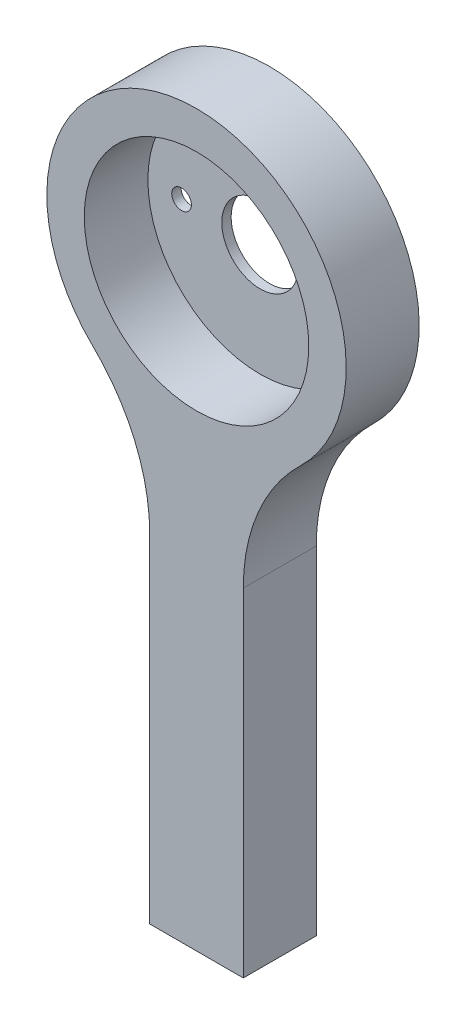
ISO-10303-21;
HEADER;
FILE_DESCRIPTION(('STEP AP214'),'2;1');
FILE_NAME('part.step','',(''),(''),'','','');
FILE_SCHEMA(('AUTOMOTIVE_DESIGN { 1 0 10303 214 1 1 1 1 }'));
ENDSEC;
DATA;
#1=APPLICATION_CONTEXT('core data for automotive mechanical design processes');
#2=APPLICATION_PROTOCOL_DEFINITION('international standard','automotive_design',2000,#1);
#3=PRODUCT_CONTEXT('',#1,'mechanical');
#4=PRODUCT('Part','Part','',(#3));
#5=PRODUCT_RELATED_PRODUCT_CATEGORY('part','',(#4));
#6=PRODUCT_DEFINITION_FORMATION('','',#4);
#7=PRODUCT_DEFINITION_CONTEXT('part definition',#1,'design');
#8=PRODUCT_DEFINITION('design','',#6,#7);
#9=PRODUCT_DEFINITION_SHAPE('','',#8);
#10=(LENGTH_UNIT() NAMED_UNIT(*) SI_UNIT(.MILLI.,.METRE.));
#11=(NAMED_UNIT(*) PLANE_ANGLE_UNIT() SI_UNIT($,.RADIAN.));
#12=(NAMED_UNIT(*) SI_UNIT($,.STERADIAN.) SOLID_ANGLE_UNIT());
#13=UNCERTAINTY_MEASURE_WITH_UNIT(LENGTH_MEASURE(1.E-05),#10,'distance_accuracy_value','');
#14=(GEOMETRIC_REPRESENTATION_CONTEXT(3) GLOBAL_UNCERTAINTY_ASSIGNED_CONTEXT((#13)) GLOBAL_UNIT_ASSIGNED_CONTEXT((#10,
#11,#12)) REPRESENTATION_CONTEXT('',''));
#15=CARTESIAN_POINT('',(0.,0.,0.));
#16=DIRECTION('',(0.,0.,1.));
#17=DIRECTION('',(1.,0.,0.));
#18=AXIS2_PLACEMENT_3D('',#15,#16,#17);
#19=CARTESIAN_POINT('',(0.,0.,3.9));
#20=DIRECTION('',(0.,0.,-1.));
#21=DIRECTION('',(-1.,0.,0.));
#22=AXIS2_PLACEMENT_3D('',#19,#20,#21);
#23=CYLINDRICAL_SURFACE('',#22,6.);
#24=CARTESIAN_POINT('',(0.,0.,3.9));
#25=DIRECTION('',(0.,0.,1.));
#26=DIRECTION('',(1.,0.,0.));
#27=AXIS2_PLACEMENT_3D('',#24,#25,#26);
#28=CIRCLE('',#27,6.);
#29=CARTESIAN_POINT('',(6.,0.,3.9));
#30=VERTEX_POINT('',#29);
#31=EDGE_CURVE('E126',#30,#30,#28,.T.);
#32=ORIENTED_EDGE('',*,*,#31,.T.);
#33=EDGE_LOOP('',(#32));
#34=FACE_BOUND('',#33,.T.);
#35=CARTESIAN_POINT('',(0.,0.,0.5));
#36=DIRECTION('',(0.,0.,-1.));
#37=DIRECTION('',(-1.,0.,0.));
#38=AXIS2_PLACEMENT_3D('',#35,#36,#37);
#39=CIRCLE('',#38,6.);
#40=CARTESIAN_POINT('',(-6.,0.,0.5));
#41=VERTEX_POINT('',#40);
#42=EDGE_CURVE('E40',#41,#41,#39,.T.);
#43=ORIENTED_EDGE('',*,*,#42,.T.);
#44=EDGE_LOOP('',(#43));
#45=FACE_BOUND('',#44,.T.);
#46=ADVANCED_FACE('F36',(#34,#45),#23,.F.);
#47=CARTESIAN_POINT('',(12.5,-12.9518338469886,3.9));
#48=DIRECTION('',(0.,0.,1.));
#49=DIRECTION('',(1.,0.,0.));
#50=AXIS2_PLACEMENT_3D('',#47,#48,#49);
#51=PLANE('',#50);
#52=CARTESIAN_POINT('',(12.5,-12.9518338469886,3.9));
#53=DIRECTION('',(0.,0.,-1.));
#54=DIRECTION('',(1.,0.,0.));
#55=AXIS2_PLACEMENT_3D('',#52,#53,#54);
#56=CIRCLE('',#55,10.);
#57=CARTESIAN_POINT('',(2.5,-12.9518338469886,3.9));
#58=VERTEX_POINT('',#57);
#59=CARTESIAN_POINT('',(5.55555555555555,-5.75637059866161,3.9));
#60=VERTEX_POINT('',#59);
#61=EDGE_CURVE('E134',#58,#60,#56,.T.);
#62=ORIENTED_EDGE('',*,*,#61,.T.);
#63=CARTESIAN_POINT('',(0.,0.,3.9));
#64=DIRECTION('',(0.,0.,1.));
#65=DIRECTION('',(1.,0.,0.));
#66=AXIS2_PLACEMENT_3D('',#63,#64,#65);
#67=CIRCLE('',#66,8.);
#68=CARTESIAN_POINT('',(-5.55555555555556,-5.7563705986616,3.9));
#69=VERTEX_POINT('',#68);
#70=EDGE_CURVE('E90',#60,#69,#67,.T.);
#71=ORIENTED_EDGE('',*,*,#70,.T.);
#72=CARTESIAN_POINT('',(-12.5,-12.9518338469886,3.9));
#73=DIRECTION('',(0.,0.,-1.));
#74=DIRECTION('',(-1.,0.,0.));
#75=AXIS2_PLACEMENT_3D('',#72,#73,#74);
#76=CIRCLE('',#75,10.);
#77=CARTESIAN_POINT('',(-2.5,-12.9518338469886,3.9));
#78=VERTEX_POINT('',#77);
#79=EDGE_CURVE('E104',#69,#78,#76,.T.);
#80=ORIENTED_EDGE('',*,*,#79,.T.);
#81=DIRECTION('',(0.,-1.,0.));
#82=VECTOR('',#81,1.);
#83=CARTESIAN_POINT('',(-2.5,-12.9518338469886,3.9));
#84=LINE('',#83,#82);
#85=CARTESIAN_POINT('',(-2.5,-31.,3.9));
#86=VERTEX_POINT('',#85);
#87=EDGE_CURVE('E97',#78,#86,#84,.T.);
#88=ORIENTED_EDGE('',*,*,#87,.T.);
#89=DIRECTION('',(1.,0.,0.));
#90=VECTOR('',#89,1.);
#91=CARTESIAN_POINT('',(-2.5,-31.,3.9));
#92=LINE('',#91,#90);
#93=CARTESIAN_POINT('',(2.5,-31.,3.9));
#94=VERTEX_POINT('',#93);
#95=EDGE_CURVE('E102',#86,#94,#92,.T.);
#96=ORIENTED_EDGE('',*,*,#95,.T.);
#97=DIRECTION('',(0.,1.,0.));
#98=VECTOR('',#97,1.);
#99=CARTESIAN_POINT('',(2.5,-12.9518338469886,3.9));
#100=LINE('',#99,#98);
#101=EDGE_CURVE('E54',#94,#58,#100,.T.);
#102=ORIENTED_EDGE('',*,*,#101,.T.);
#103=EDGE_LOOP('',(#62,#71,#80,#88,#96,#102));
#104=FACE_BOUND('',#103,.T.);
#105=ORIENTED_EDGE('',*,*,#31,.F.);
#106=EDGE_LOOP('',(#105));
#107=FACE_BOUND('',#106,.T.);
#108=ADVANCED_FACE('F99',(#104,#107),#51,.T.);
#109=CARTESIAN_POINT('',(12.5,-12.9518338469886,0.));
#110=DIRECTION('',(0.,0.,1.));
#111=DIRECTION('',(1.,0.,0.));
#112=AXIS2_PLACEMENT_3D('',#109,#110,#111);
#113=PLANE('',#112);
#114=CARTESIAN_POINT('',(-12.5,-12.9518338469886,0.));
#115=DIRECTION('',(0.,0.,-1.));
#116=DIRECTION('',(-1.,0.,0.));
#117=AXIS2_PLACEMENT_3D('',#114,#115,#116);
#118=CIRCLE('',#117,10.);
#119=CARTESIAN_POINT('',(-5.55555555555556,-5.7563705986616,0.));
#120=VERTEX_POINT('',#119);
#121=CARTESIAN_POINT('',(-2.5,-12.9518338469886,0.));
#122=VERTEX_POINT('',#121);
#123=EDGE_CURVE('E129',#120,#122,#118,.T.);
#124=ORIENTED_EDGE('',*,*,#123,.F.);
#125=CARTESIAN_POINT('',(0.,0.,0.));
#126=DIRECTION('',(0.,0.,1.));
#127=DIRECTION('',(1.,0.,0.));
#128=AXIS2_PLACEMENT_3D('',#125,#126,#127);
#129=CIRCLE('',#128,8.);
#130=CARTESIAN_POINT('',(5.55555555555555,-5.75637059866161,0.));
#131=VERTEX_POINT('',#130);
#132=EDGE_CURVE('E125',#131,#120,#129,.T.);
#133=ORIENTED_EDGE('',*,*,#132,.F.);
#134=CARTESIAN_POINT('',(12.5,-12.9518338469886,0.));
#135=DIRECTION('',(0.,0.,-1.));
#136=DIRECTION('',(1.,0.,0.));
#137=AXIS2_PLACEMENT_3D('',#134,#135,#136);
#138=CIRCLE('',#137,10.);
#139=CARTESIAN_POINT('',(2.5,-12.9518338469886,0.));
#140=VERTEX_POINT('',#139);
#141=EDGE_CURVE('E122',#140,#131,#138,.T.);
#142=ORIENTED_EDGE('',*,*,#141,.F.);
#143=DIRECTION('',(0.,1.,0.));
#144=VECTOR('',#143,1.);
#145=CARTESIAN_POINT('',(2.5,-12.9518338469886,0.));
#146=LINE('',#145,#144);
#147=CARTESIAN_POINT('',(2.5,-31.,0.));
#148=VERTEX_POINT('',#147);
#149=EDGE_CURVE('E82',#148,#140,#146,.T.);
#150=ORIENTED_EDGE('',*,*,#149,.F.);
#151=DIRECTION('',(1.,0.,0.));
#152=VECTOR('',#151,1.);
#153=CARTESIAN_POINT('',(-2.5,-31.,0.));
#154=LINE('',#153,#152);
#155=CARTESIAN_POINT('',(-2.5,-31.,0.));
#156=VERTEX_POINT('',#155);
#157=EDGE_CURVE('E76',#156,#148,#154,.T.);
#158=ORIENTED_EDGE('',*,*,#157,.F.);
#159=DIRECTION('',(0.,-1.,0.));
#160=VECTOR('',#159,1.);
#161=CARTESIAN_POINT('',(-2.5,-12.9518338469886,0.));
#162=LINE('',#161,#160);
#163=EDGE_CURVE('E112',#122,#156,#162,.T.);
#164=ORIENTED_EDGE('',*,*,#163,.F.);
#165=EDGE_LOOP('',(#124,#133,#142,#150,#158,#164));
#166=FACE_BOUND('',#165,.T.);
#167=CARTESIAN_POINT('',(0.,0.,0.));
#168=DIRECTION('',(0.,0.,-1.));
#169=DIRECTION('',(-1.,0.,0.));
#170=AXIS2_PLACEMENT_3D('',#167,#168,#169);
#171=CIRCLE('',#170,2.05);
#172=CARTESIAN_POINT('',(-2.05,0.,0.));
#173=VERTEX_POINT('',#172);
#174=EDGE_CURVE('E273',#173,#173,#171,.T.);
#175=ORIENTED_EDGE('',*,*,#174,.F.);
#176=EDGE_LOOP('',(#175));
#177=FACE_BOUND('',#176,.T.);
#178=CARTESIAN_POINT('',(-4.2,0.,0.));
#179=DIRECTION('',(0.,0.,-1.));
#180=DIRECTION('',(-1.,0.,0.));
#181=AXIS2_PLACEMENT_3D('',#178,#179,#180);
#182=CIRCLE('',#181,0.525);
#183=CARTESIAN_POINT('',(-4.725,0.,0.));
#184=VERTEX_POINT('',#183);
#185=EDGE_CURVE('E267',#184,#184,#182,.T.);
#186=ORIENTED_EDGE('',*,*,#185,.F.);
#187=EDGE_LOOP('',(#186));
#188=FACE_BOUND('',#187,.T.);
#189=CARTESIAN_POINT('',(4.2,0.,0.));
#190=DIRECTION('',(0.,0.,-1.));
#191=DIRECTION('',(-1.,0.,0.));
#192=AXIS2_PLACEMENT_3D('',#189,#190,#191);
#193=CIRCLE('',#192,0.525);
#194=CARTESIAN_POINT('',(3.675,0.,0.));
#195=VERTEX_POINT('',#194);
#196=EDGE_CURVE('E264',#195,#195,#193,.T.);
#197=ORIENTED_EDGE('',*,*,#196,.F.);
#198=EDGE_LOOP('',(#197));
#199=FACE_BOUND('',#198,.T.);
#200=ADVANCED_FACE('F146',(#166,#177,#188,#199),#113,.F.);
#201=CARTESIAN_POINT('',(12.5,-12.9518338469886,3.9));
#202=DIRECTION('',(0.,0.,-1.));
#203=DIRECTION('',(-1.,0.,0.));
#204=AXIS2_PLACEMENT_3D('',#201,#202,#203);
#205=CYLINDRICAL_SURFACE('',#204,10.);
#206=ORIENTED_EDGE('',*,*,#141,.T.);
#207=DIRECTION('',(0.,0.,-1.));
#208=VECTOR('',#207,1.);
#209=CARTESIAN_POINT('',(5.55555555555555,-5.75637059866161,3.9));
#210=LINE('',#209,#208);
#211=EDGE_CURVE('E11',#60,#131,#210,.T.);
#212=ORIENTED_EDGE('',*,*,#211,.F.);
#213=ORIENTED_EDGE('',*,*,#61,.F.);
#214=DIRECTION('',(0.,0.,-1.));
#215=VECTOR('',#214,1.);
#216=CARTESIAN_POINT('',(2.5,-12.9518338469886,3.9));
#217=LINE('',#216,#215);
#218=EDGE_CURVE('E118',#58,#140,#217,.T.);
#219=ORIENTED_EDGE('',*,*,#218,.T.);
#220=EDGE_LOOP('',(#206,#212,#213,#219));
#221=FACE_BOUND('',#220,.T.);
#222=ADVANCED_FACE('F38',(#221),#205,.F.);
#223=CARTESIAN_POINT('',(0.,0.,3.9));
#224=DIRECTION('',(0.,0.,-1.));
#225=DIRECTION('',(-1.,0.,0.));
#226=AXIS2_PLACEMENT_3D('',#223,#224,#225);
#227=CYLINDRICAL_SURFACE('',#226,8.);
#228=ORIENTED_EDGE('',*,*,#132,.T.);
#229=DIRECTION('',(0.,0.,-1.));
#230=VECTOR('',#229,1.);
#231=CARTESIAN_POINT('',(-5.55555555555556,-5.7563705986616,3.9));
#232=LINE('',#231,#230);
#233=EDGE_CURVE('E46',#69,#120,#232,.T.);
#234=ORIENTED_EDGE('',*,*,#233,.F.);
#235=ORIENTED_EDGE('',*,*,#70,.F.);
#236=ORIENTED_EDGE('',*,*,#211,.T.);
#237=EDGE_LOOP('',(#228,#234,#235,#236));
#238=FACE_BOUND('',#237,.T.);
#239=ADVANCED_FACE('F142',(#238),#227,.T.);
#240=CARTESIAN_POINT('',(-12.5,-12.9518338469886,3.9));
#241=DIRECTION('',(0.,0.,-1.));
#242=DIRECTION('',(-1.,0.,0.));
#243=AXIS2_PLACEMENT_3D('',#240,#241,#242);
#244=CYLINDRICAL_SURFACE('',#243,10.);
#245=ORIENTED_EDGE('',*,*,#123,.T.);
#246=DIRECTION('',(0.,0.,-1.));
#247=VECTOR('',#246,1.);
#248=CARTESIAN_POINT('',(-2.5,-12.9518338469886,3.9));
#249=LINE('',#248,#247);
#250=EDGE_CURVE('E113',#78,#122,#249,.T.);
#251=ORIENTED_EDGE('',*,*,#250,.F.);
#252=ORIENTED_EDGE('',*,*,#79,.F.);
#253=ORIENTED_EDGE('',*,*,#233,.T.);
#254=EDGE_LOOP('',(#245,#251,#252,#253));
#255=FACE_BOUND('',#254,.T.);
#256=ADVANCED_FACE('F139',(#255),#244,.F.);
#257=CARTESIAN_POINT('',(-2.5,-12.9518338469886,3.9));
#258=DIRECTION('',(1.,0.,0.));
#259=DIRECTION('',(0.,1.,0.));
#260=AXIS2_PLACEMENT_3D('',#257,#258,#259);
#261=PLANE('',#260);
#262=ORIENTED_EDGE('',*,*,#163,.T.);
#263=DIRECTION('',(0.,0.,-1.));
#264=VECTOR('',#263,1.);
#265=CARTESIAN_POINT('',(-2.5,-31.,3.9));
#266=LINE('',#265,#264);
#267=EDGE_CURVE('E109',#86,#156,#266,.T.);
#268=ORIENTED_EDGE('',*,*,#267,.F.);
#269=ORIENTED_EDGE('',*,*,#87,.F.);
#270=ORIENTED_EDGE('',*,*,#250,.T.);
#271=EDGE_LOOP('',(#262,#268,#269,#270));
#272=FACE_BOUND('',#271,.T.);
#273=ADVANCED_FACE('F110',(#272),#261,.F.);
#274=CARTESIAN_POINT('',(-2.5,-31.,3.9));
#275=DIRECTION('',(0.,1.,0.));
#276=DIRECTION('',(0.,0.,1.));
#277=AXIS2_PLACEMENT_3D('',#274,#275,#276);
#278=PLANE('',#277);
#279=ORIENTED_EDGE('',*,*,#157,.T.);
#280=DIRECTION('',(0.,0.,-1.));
#281=VECTOR('',#280,1.);
#282=CARTESIAN_POINT('',(2.5,-31.,3.9));
#283=LINE('',#282,#281);
#284=EDGE_CURVE('E114',#94,#148,#283,.T.);
#285=ORIENTED_EDGE('',*,*,#284,.F.);
#286=ORIENTED_EDGE('',*,*,#95,.F.);
#287=ORIENTED_EDGE('',*,*,#267,.T.);
#288=EDGE_LOOP('',(#279,#285,#286,#287));
#289=FACE_BOUND('',#288,.T.);
#290=ADVANCED_FACE('F116',(#289),#278,.F.);
#291=CARTESIAN_POINT('',(2.5,-12.9518338469886,3.9));
#292=DIRECTION('',(-1.,0.,0.));
#293=DIRECTION('',(0.,-1.,0.));
#294=AXIS2_PLACEMENT_3D('',#291,#292,#293);
#295=PLANE('',#294);
#296=ORIENTED_EDGE('',*,*,#149,.T.);
#297=ORIENTED_EDGE('',*,*,#218,.F.);
#298=ORIENTED_EDGE('',*,*,#101,.F.);
#299=ORIENTED_EDGE('',*,*,#284,.T.);
#300=EDGE_LOOP('',(#296,#297,#298,#299));
#301=FACE_BOUND('',#300,.T.);
#302=ADVANCED_FACE('F150',(#301),#295,.F.);
#303=CARTESIAN_POINT('',(0.,0.,0.5));
#304=DIRECTION('',(0.,0.,-1.));
#305=DIRECTION('',(-1.,0.,0.));
#306=AXIS2_PLACEMENT_3D('',#303,#304,#305);
#307=PLANE('',#306);
#308=CARTESIAN_POINT('',(0.,0.,0.5));
#309=DIRECTION('',(0.,0.,-1.));
#310=DIRECTION('',(-1.,0.,0.));
#311=AXIS2_PLACEMENT_3D('',#308,#309,#310);
#312=CIRCLE('',#311,2.05);
#313=CARTESIAN_POINT('',(-2.05,0.,0.5));
#314=VERTEX_POINT('',#313);
#315=EDGE_CURVE('E276',#314,#314,#312,.T.);
#316=ORIENTED_EDGE('',*,*,#315,.T.);
#317=EDGE_LOOP('',(#316));
#318=FACE_BOUND('',#317,.T.);
#319=CARTESIAN_POINT('',(-4.2,0.,0.5));
#320=DIRECTION('',(0.,0.,-1.));
#321=DIRECTION('',(-1.,0.,0.));
#322=AXIS2_PLACEMENT_3D('',#319,#320,#321);
#323=CIRCLE('',#322,0.525);
#324=CARTESIAN_POINT('',(-4.725,0.,0.5));
#325=VERTEX_POINT('',#324);
#326=EDGE_CURVE('E270',#325,#325,#323,.T.);
#327=ORIENTED_EDGE('',*,*,#326,.T.);
#328=EDGE_LOOP('',(#327));
#329=FACE_BOUND('',#328,.T.);
#330=CARTESIAN_POINT('',(4.2,0.,0.5));
#331=DIRECTION('',(0.,0.,-1.));
#332=DIRECTION('',(-1.,0.,0.));
#333=AXIS2_PLACEMENT_3D('',#330,#331,#332);
#334=CIRCLE('',#333,0.525);
#335=CARTESIAN_POINT('',(3.675,0.,0.5));
#336=VERTEX_POINT('',#335);
#337=EDGE_CURVE('E261',#336,#336,#334,.T.);
#338=ORIENTED_EDGE('',*,*,#337,.T.);
#339=EDGE_LOOP('',(#338));
#340=FACE_BOUND('',#339,.T.);
#341=ORIENTED_EDGE('',*,*,#42,.F.);
#342=EDGE_LOOP('',(#341));
#343=FACE_BOUND('',#342,.T.);
#344=ADVANCED_FACE('F152',(#318,#329,#340,#343),#307,.F.);
#345=CARTESIAN_POINT('',(0.,0.,0.5));
#346=DIRECTION('',(0.,0.,-1.));
#347=DIRECTION('',(-1.,0.,0.));
#348=AXIS2_PLACEMENT_3D('',#345,#346,#347);
#349=CYLINDRICAL_SURFACE('',#348,2.05);
#350=ORIENTED_EDGE('',*,*,#315,.F.);
#351=EDGE_LOOP('',(#350));
#352=FACE_BOUND('',#351,.T.);
#353=ORIENTED_EDGE('',*,*,#174,.T.);
#354=EDGE_LOOP('',(#353));
#355=FACE_BOUND('',#354,.T.);
#356=ADVANCED_FACE('F158',(#352,#355),#349,.F.);
#357=CARTESIAN_POINT('',(-4.2,0.,0.5));
#358=DIRECTION('',(0.,0.,-1.));
#359=DIRECTION('',(-1.,0.,0.));
#360=AXIS2_PLACEMENT_3D('',#357,#358,#359);
#361=CYLINDRICAL_SURFACE('',#360,0.525);
#362=ORIENTED_EDGE('',*,*,#326,.F.);
#363=EDGE_LOOP('',(#362));
#364=FACE_BOUND('',#363,.T.);
#365=ORIENTED_EDGE('',*,*,#185,.T.);
#366=EDGE_LOOP('',(#365));
#367=FACE_BOUND('',#366,.T.);
#368=ADVANCED_FACE('F235',(#364,#367),#361,.F.);
#369=CARTESIAN_POINT('',(4.2,0.,0.5));
#370=DIRECTION('',(0.,0.,-1.));
#371=DIRECTION('',(-1.,0.,0.));
#372=AXIS2_PLACEMENT_3D('',#369,#370,#371);
#373=CYLINDRICAL_SURFACE('',#372,0.525);
#374=ORIENTED_EDGE('',*,*,#337,.F.);
#375=EDGE_LOOP('',(#374));
#376=FACE_BOUND('',#375,.T.);
#377=ORIENTED_EDGE('',*,*,#196,.T.);
#378=EDGE_LOOP('',(#377));
#379=FACE_BOUND('',#378,.T.);
#380=ADVANCED_FACE('F244',(#376,#379),#373,.F.);
#381=CLOSED_SHELL('',(#46,#108,#200,#222,#239,#256,#273,#290,#302,#344,#356,#368,#380));
#382=MANIFOLD_SOLID_BREP('B2',#381);
#383=ADVANCED_BREP_SHAPE_REPRESENTATION('',(#18,#382),#14);
#384=SHAPE_DEFINITION_REPRESENTATION(#9,#383);
ENDSEC;
END-ISO-10303-21;
